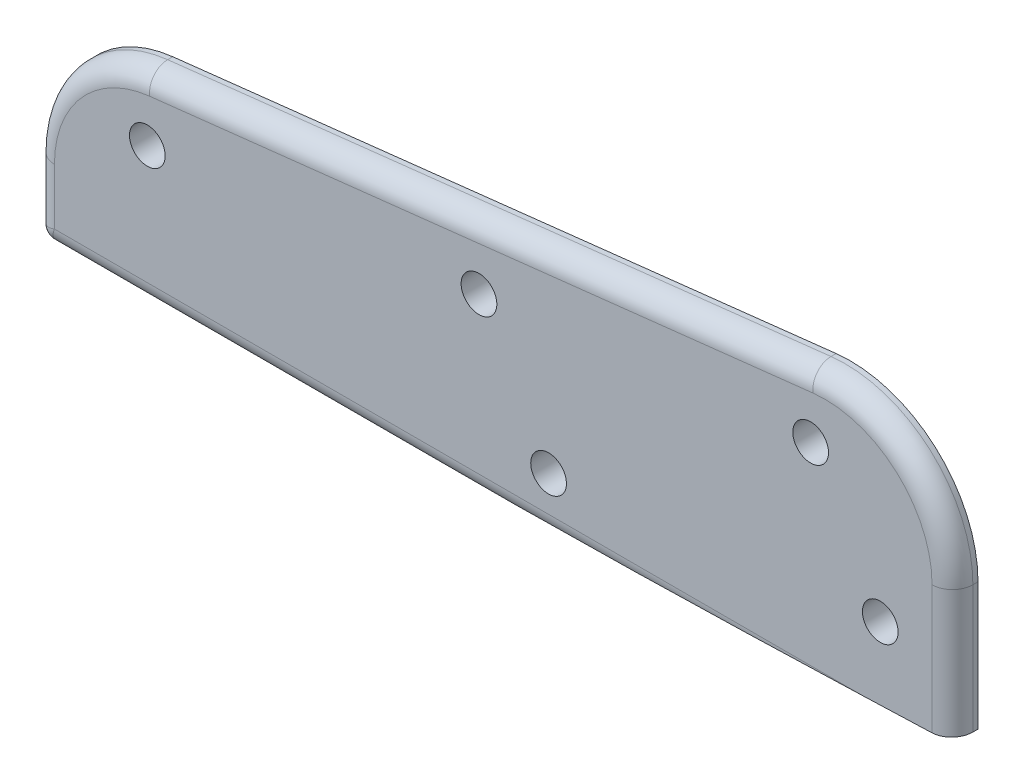
ISO-10303-21;
HEADER;
FILE_DESCRIPTION(('STEP AP214'),'2;1');
FILE_NAME('part.step','',(''),(''),'','','');
FILE_SCHEMA(('AUTOMOTIVE_DESIGN { 1 0 10303 214 1 1 1 1 }'));
ENDSEC;
DATA;
#1=APPLICATION_CONTEXT('core data for automotive mechanical design processes');
#2=APPLICATION_PROTOCOL_DEFINITION('international standard','automotive_design',2000,#1);
#3=PRODUCT_CONTEXT('',#1,'mechanical');
#4=PRODUCT('Part','Part','',(#3));
#5=PRODUCT_RELATED_PRODUCT_CATEGORY('part','',(#4));
#6=PRODUCT_DEFINITION_FORMATION('','',#4);
#7=PRODUCT_DEFINITION_CONTEXT('part definition',#1,'design');
#8=PRODUCT_DEFINITION('design','',#6,#7);
#9=PRODUCT_DEFINITION_SHAPE('','',#8);
#10=(LENGTH_UNIT() NAMED_UNIT(*) SI_UNIT(.MILLI.,.METRE.));
#11=(NAMED_UNIT(*) PLANE_ANGLE_UNIT() SI_UNIT($,.RADIAN.));
#12=(NAMED_UNIT(*) SI_UNIT($,.STERADIAN.) SOLID_ANGLE_UNIT());
#13=UNCERTAINTY_MEASURE_WITH_UNIT(LENGTH_MEASURE(1.E-05),#10,'distance_accuracy_value','');
#14=(GEOMETRIC_REPRESENTATION_CONTEXT(3) GLOBAL_UNCERTAINTY_ASSIGNED_CONTEXT((#13)) GLOBAL_UNIT_ASSIGNED_CONTEXT((#10,
#11,#12)) REPRESENTATION_CONTEXT('',''));
#15=CARTESIAN_POINT('',(0.,0.,0.));
#16=DIRECTION('',(0.,0.,1.));
#17=DIRECTION('',(1.,0.,0.));
#18=AXIS2_PLACEMENT_3D('',#15,#16,#17);
#19=CARTESIAN_POINT('',(-483.453171779433,1624.630304703,3065.));
#20=DIRECTION('',(0.,0.,-1.));
#21=DIRECTION('',(-1.,0.,0.));
#22=AXIS2_PLACEMENT_3D('',#19,#20,#21);
#23=CYLINDRICAL_SURFACE('',#22,49.9999999999999);
#24=DIRECTION('',(0.,0.,-1.));
#25=VECTOR('',#24,1.);
#26=CARTESIAN_POINT('',(-489.042910432827,1674.31687051094,3065.));
#27=LINE('',#26,#25);
#28=CARTESIAN_POINT('',(-489.042910432827,1674.31687051094,3057.));
#29=VERTEX_POINT('',#28);
#30=CARTESIAN_POINT('',(-489.042910432827,1674.31687051094,3055.));
#31=VERTEX_POINT('',#30);
#32=EDGE_CURVE('E120',#29,#31,#27,.T.);
#33=ORIENTED_EDGE('',*,*,#32,.F.);
#34=CARTESIAN_POINT('',(-483.453171779433,1624.630304703,3057.));
#35=DIRECTION('',(0.,0.,1.));
#36=DIRECTION('',(1.,0.,0.));
#37=AXIS2_PLACEMENT_3D('',#34,#35,#36);
#38=CIRCLE('',#37,49.9999999999999);
#39=CARTESIAN_POINT('',(-433.453171779433,1624.630304703,3057.));
#40=VERTEX_POINT('',#39);
#41=EDGE_CURVE('E204',#29,#40,#38,.F.);
#42=ORIENTED_EDGE('',*,*,#41,.T.);
#43=DIRECTION('',(0.,0.,-1.));
#44=VECTOR('',#43,1.);
#45=CARTESIAN_POINT('',(-433.453171779433,1624.630304703,3065.));
#46=LINE('',#45,#44);
#47=CARTESIAN_POINT('',(-433.453171779433,1624.630304703,3055.));
#48=VERTEX_POINT('',#47);
#49=EDGE_CURVE('E142',#40,#48,#46,.T.);
#50=ORIENTED_EDGE('',*,*,#49,.T.);
#51=CARTESIAN_POINT('',(-483.453171779433,1624.630304703,3055.));
#52=DIRECTION('',(0.,0.,1.));
#53=DIRECTION('',(1.,0.,0.));
#54=AXIS2_PLACEMENT_3D('',#51,#52,#53);
#55=CIRCLE('',#54,49.9999999999999);
#56=EDGE_CURVE('E136',#48,#31,#55,.T.);
#57=ORIENTED_EDGE('',*,*,#56,.T.);
#58=EDGE_LOOP('',(#33,#42,#50,#57));
#59=FACE_BOUND('',#58,.T.);
#60=ADVANCED_FACE('F36',(#59),#23,.T.);
#61=CARTESIAN_POINT('',(-489.042910432827,1674.31687051094,3065.));
#62=DIRECTION('',(0.111794773067865,-0.993731316158802,0.));
#63=DIRECTION('',(0.993731316158802,0.111794773067865,0.));
#64=AXIS2_PLACEMENT_3D('',#61,#62,#63);
#65=PLANE('',#64);
#66=DIRECTION('',(0.,0.,-1.));
#67=VECTOR('',#66,1.);
#68=CARTESIAN_POINT('',(-749.042910432826,1645.06687051094,3065.));
#69=LINE('',#68,#67);
#70=CARTESIAN_POINT('',(-749.042910432826,1645.06687051094,3057.));
#71=VERTEX_POINT('',#70);
#72=CARTESIAN_POINT('',(-749.042910432826,1645.06687051094,3055.));
#73=VERTEX_POINT('',#72);
#74=EDGE_CURVE('E129',#71,#73,#69,.T.);
#75=ORIENTED_EDGE('',*,*,#74,.F.);
#76=DIRECTION('',(-0.993731316158802,-0.111794773067865,0.));
#77=VECTOR('',#76,1.);
#78=CARTESIAN_POINT('',(-489.042910432827,1674.31687051094,3057.));
#79=LINE('',#78,#77);
#80=EDGE_CURVE('E45',#71,#29,#79,.F.);
#81=ORIENTED_EDGE('',*,*,#80,.T.);
#82=ORIENTED_EDGE('',*,*,#32,.T.);
#83=DIRECTION('',(-0.993731316158802,-0.111794773067865,0.));
#84=VECTOR('',#83,1.);
#85=CARTESIAN_POINT('',(-489.042910432827,1674.31687051094,3055.));
#86=LINE('',#85,#84);
#87=EDGE_CURVE('E123',#31,#73,#86,.T.);
#88=ORIENTED_EDGE('',*,*,#87,.T.);
#89=EDGE_LOOP('',(#75,#81,#82,#88));
#90=FACE_BOUND('',#89,.T.);
#91=ADVANCED_FACE('F122',(#90),#65,.F.);
#92=CARTESIAN_POINT('',(-743.453171779433,1595.380304703,3065.));
#93=DIRECTION('',(0.,0.,-1.));
#94=DIRECTION('',(-1.,0.,0.));
#95=AXIS2_PLACEMENT_3D('',#92,#93,#94);
#96=CYLINDRICAL_SURFACE('',#95,49.9999999999999);
#97=DIRECTION('',(0.,0.,-1.));
#98=VECTOR('',#97,1.);
#99=CARTESIAN_POINT('',(-793.453171779433,1595.380304703,3065.));
#100=LINE('',#99,#98);
#101=CARTESIAN_POINT('',(-793.453171779433,1595.380304703,3057.));
#102=VERTEX_POINT('',#101);
#103=CARTESIAN_POINT('',(-793.453171779433,1595.380304703,3055.));
#104=VERTEX_POINT('',#103);
#105=EDGE_CURVE('E170',#102,#104,#100,.T.);
#106=ORIENTED_EDGE('',*,*,#105,.F.);
#107=CARTESIAN_POINT('',(-743.453171779433,1595.380304703,3057.));
#108=DIRECTION('',(0.,0.,1.));
#109=DIRECTION('',(1.,0.,0.));
#110=AXIS2_PLACEMENT_3D('',#107,#108,#109);
#111=CIRCLE('',#110,49.9999999999999);
#112=EDGE_CURVE('E11',#102,#71,#111,.F.);
#113=ORIENTED_EDGE('',*,*,#112,.T.);
#114=ORIENTED_EDGE('',*,*,#74,.T.);
#115=CARTESIAN_POINT('',(-743.453171779433,1595.380304703,3055.));
#116=DIRECTION('',(0.,0.,-1.));
#117=DIRECTION('',(-1.,0.,0.));
#118=AXIS2_PLACEMENT_3D('',#115,#116,#117);
#119=CIRCLE('',#118,49.9999999999999);
#120=EDGE_CURVE('E139',#104,#73,#119,.T.);
#121=ORIENTED_EDGE('',*,*,#120,.F.);
#122=EDGE_LOOP('',(#106,#113,#114,#121));
#123=FACE_BOUND('',#122,.T.);
#124=ADVANCED_FACE('F254',(#123),#96,.T.);
#125=CARTESIAN_POINT('',(-793.453171779433,1595.380304703,3065.));
#126=DIRECTION('',(1.,0.,0.));
#127=DIRECTION('',(0.,1.,0.));
#128=AXIS2_PLACEMENT_3D('',#125,#126,#127);
#129=PLANE('',#128);
#130=DIRECTION('',(0.,0.,-1.));
#131=VECTOR('',#130,1.);
#132=CARTESIAN_POINT('',(-793.453171779433,1570.380304703,3065.));
#133=LINE('',#132,#131);
#134=CARTESIAN_POINT('',(-793.453171779433,1570.380304703,3055.));
#135=VERTEX_POINT('',#134);
#136=CARTESIAN_POINT('',(-793.453171779433,1570.380304703,3057.));
#137=VERTEX_POINT('',#136);
#138=EDGE_CURVE('E176',#135,#137,#133,.F.);
#139=ORIENTED_EDGE('',*,*,#138,.T.);
#140=DIRECTION('',(0.,-1.,0.));
#141=VECTOR('',#140,1.);
#142=CARTESIAN_POINT('',(-793.453171779433,1595.380304703,3057.));
#143=LINE('',#142,#141);
#144=EDGE_CURVE('E200',#137,#102,#143,.F.);
#145=ORIENTED_EDGE('',*,*,#144,.T.);
#146=ORIENTED_EDGE('',*,*,#105,.T.);
#147=DIRECTION('',(0.,-1.,0.));
#148=VECTOR('',#147,1.);
#149=CARTESIAN_POINT('',(-793.453171779433,1595.380304703,3055.));
#150=LINE('',#149,#148);
#151=EDGE_CURVE('E154',#104,#135,#150,.T.);
#152=ORIENTED_EDGE('',*,*,#151,.T.);
#153=EDGE_LOOP('',(#139,#145,#146,#152));
#154=FACE_BOUND('',#153,.T.);
#155=ADVANCED_FACE('F302',(#154),#129,.F.);
#156=CARTESIAN_POINT('',(-793.453171779433,1565.380304703,3065.));
#157=DIRECTION('',(0.,1.,0.));
#158=DIRECTION('',(0.,0.,1.));
#159=AXIS2_PLACEMENT_3D('',#156,#157,#158);
#160=PLANE('',#159);
#161=DIRECTION('',(0.,0.,-1.));
#162=VECTOR('',#161,1.);
#163=CARTESIAN_POINT('',(-693.453171779433,1565.380304703,3065.));
#164=LINE('',#163,#162);
#165=CARTESIAN_POINT('',(-693.453171779433,1565.380304703,3057.));
#166=VERTEX_POINT('',#165);
#167=CARTESIAN_POINT('',(-693.453171779433,1565.380304703,3055.));
#168=VERTEX_POINT('',#167);
#169=EDGE_CURVE('E168',#166,#168,#164,.T.);
#170=ORIENTED_EDGE('',*,*,#169,.F.);
#171=DIRECTION('',(1.,0.,0.));
#172=VECTOR('',#171,1.);
#173=CARTESIAN_POINT('',(-788.453171779433,1565.380304703,3057.));
#174=LINE('',#173,#172);
#175=CARTESIAN_POINT('',(-788.453171779433,1565.380304703,3057.));
#176=VERTEX_POINT('',#175);
#177=EDGE_CURVE('E196',#166,#176,#174,.F.);
#178=ORIENTED_EDGE('',*,*,#177,.T.);
#179=DIRECTION('',(0.,0.,-1.));
#180=VECTOR('',#179,1.);
#181=CARTESIAN_POINT('',(-788.453171779433,1565.380304703,3065.));
#182=LINE('',#181,#180);
#183=CARTESIAN_POINT('',(-788.453171779433,1565.380304703,3055.));
#184=VERTEX_POINT('',#183);
#185=EDGE_CURVE('E128',#176,#184,#182,.T.);
#186=ORIENTED_EDGE('',*,*,#185,.T.);
#187=DIRECTION('',(1.,0.,0.));
#188=VECTOR('',#187,1.);
#189=CARTESIAN_POINT('',(-793.453171779433,1565.380304703,3055.));
#190=LINE('',#189,#188);
#191=EDGE_CURVE('E157',#184,#168,#190,.T.);
#192=ORIENTED_EDGE('',*,*,#191,.T.);
#193=EDGE_LOOP('',(#170,#178,#186,#192));
#194=FACE_BOUND('',#193,.T.);
#195=ADVANCED_FACE('F307',(#194),#160,.F.);
#196=CARTESIAN_POINT('',(-693.453171779433,1565.380304703,3065.));
#197=DIRECTION('',(-0.0355544292615045,0.999367741404479,0.));
#198=DIRECTION('',(-0.999367741404479,-0.0355544292615045,0.));
#199=AXIS2_PLACEMENT_3D('',#196,#197,#198);
#200=PLANE('',#199);
#201=DIRECTION('',(0.999367741404478,0.0355544292615045,0.));
#202=VECTOR('',#201,1.);
#203=CARTESIAN_POINT('',(-693.453171779433,1565.380304703,3065.));
#204=LINE('',#203,#202);
#205=CARTESIAN_POINT('',(-468.588306914562,1573.380304703,3065.));
#206=VERTEX_POINT('',#205);
#207=CARTESIAN_POINT('',(-441.453171779433,1574.34568931838,3065.));
#208=VERTEX_POINT('',#207);
#209=EDGE_CURVE('E150',#206,#208,#204,.T.);
#210=ORIENTED_EDGE('',*,*,#209,.F.);
#211=CARTESIAN_POINT('',(-468.588306914562,1573.380304703,3057.));
#212=DIRECTION('',(-0.0355544292615045,0.999367741404479,0.));
#213=DIRECTION('',(-0.999367741404479,-0.0355544292615045,0.));
#214=AXIS2_PLACEMENT_3D('',#211,#212,#213);
#215=ELLIPSE('',#214,225.007127555321,8.);
#216=EDGE_CURVE('E194',#206,#166,#215,.F.);
#217=ORIENTED_EDGE('',*,*,#216,.T.);
#218=ORIENTED_EDGE('',*,*,#169,.T.);
#219=DIRECTION('',(0.999367741404478,0.0355544292615045,0.));
#220=VECTOR('',#219,1.);
#221=CARTESIAN_POINT('',(-693.453171779433,1565.380304703,3055.));
#222=LINE('',#221,#220);
#223=CARTESIAN_POINT('',(-433.453171779433,1574.630304703,3055.));
#224=VERTEX_POINT('',#223);
#225=EDGE_CURVE('E160',#168,#224,#222,.T.);
#226=ORIENTED_EDGE('',*,*,#225,.T.);
#227=DIRECTION('',(0.,0.,-1.));
#228=VECTOR('',#227,1.);
#229=CARTESIAN_POINT('',(-433.453171779433,1574.630304703,3065.));
#230=LINE('',#229,#228);
#231=CARTESIAN_POINT('',(-433.453171779433,1574.630304703,3057.));
#232=VERTEX_POINT('',#231);
#233=EDGE_CURVE('E166',#232,#224,#230,.T.);
#234=ORIENTED_EDGE('',*,*,#233,.F.);
#235=CARTESIAN_POINT('',(-441.453171779433,1574.34568931838,3057.));
#236=DIRECTION('',(-0.0355544292615045,0.999367741404479,0.));
#237=DIRECTION('',(-0.999367741404479,-0.0355544292615045,0.));
#238=AXIS2_PLACEMENT_3D('',#235,#236,#237);
#239=ELLIPSE('',#238,8.00506126879487,8.);
#240=EDGE_CURVE('E192',#232,#208,#239,.F.);
#241=ORIENTED_EDGE('',*,*,#240,.T.);
#242=EDGE_LOOP('',(#210,#217,#218,#226,#234,#241));
#243=FACE_BOUND('',#242,.T.);
#244=ADVANCED_FACE('F283',(#243),#200,.F.);
#245=CARTESIAN_POINT('',(-433.453171779433,1574.630304703,3065.));
#246=DIRECTION('',(-1.,0.,0.));
#247=DIRECTION('',(0.,0.,1.));
#248=AXIS2_PLACEMENT_3D('',#245,#246,#247);
#249=PLANE('',#248);
#250=ORIENTED_EDGE('',*,*,#49,.F.);
#251=DIRECTION('',(0.,1.,0.));
#252=VECTOR('',#251,1.);
#253=CARTESIAN_POINT('',(-433.453171779433,1574.630304703,3057.));
#254=LINE('',#253,#252);
#255=EDGE_CURVE('E202',#40,#232,#254,.F.);
#256=ORIENTED_EDGE('',*,*,#255,.T.);
#257=ORIENTED_EDGE('',*,*,#233,.T.);
#258=DIRECTION('',(0.,1.,0.));
#259=VECTOR('',#258,1.);
#260=CARTESIAN_POINT('',(-433.453171779433,1574.630304703,3055.));
#261=LINE('',#260,#259);
#262=EDGE_CURVE('E163',#224,#48,#261,.T.);
#263=ORIENTED_EDGE('',*,*,#262,.T.);
#264=EDGE_LOOP('',(#250,#256,#257,#263));
#265=FACE_BOUND('',#264,.T.);
#266=ADVANCED_FACE('F314',(#265),#249,.F.);
#267=CARTESIAN_POINT('',(-483.453171779433,1624.630304703,3065.));
#268=DIRECTION('',(0.,0.,1.));
#269=DIRECTION('',(1.,0.,0.));
#270=AXIS2_PLACEMENT_3D('',#267,#268,#269);
#271=PLANE('',#270);
#272=CARTESIAN_POINT('',(-489.042910432827,1649.15916480772,3065.));
#273=DIRECTION('',(0.,0.,-1.));
#274=DIRECTION('',(-1.,0.,0.));
#275=AXIS2_PLACEMENT_3D('',#272,#273,#274);
#276=CIRCLE('',#275,7.00000000000004);
#277=CARTESIAN_POINT('',(-496.042910432827,1649.15916480772,3065.));
#278=VERTEX_POINT('',#277);
#279=EDGE_CURVE('E144',#278,#278,#276,.T.);
#280=ORIENTED_EDGE('',*,*,#279,.T.);
#281=EDGE_LOOP('',(#280));
#282=FACE_BOUND('',#281,.T.);
#283=CARTESIAN_POINT('',(-619.042910432827,1634.53416480772,3065.));
#284=DIRECTION('',(0.,0.,-1.));
#285=DIRECTION('',(-1.,0.,0.));
#286=AXIS2_PLACEMENT_3D('',#283,#284,#285);
#287=CIRCLE('',#286,7.00000000000004);
#288=CARTESIAN_POINT('',(-626.042910432827,1634.53416480772,3065.));
#289=VERTEX_POINT('',#288);
#290=EDGE_CURVE('E343',#289,#289,#287,.T.);
#291=ORIENTED_EDGE('',*,*,#290,.T.);
#292=EDGE_LOOP('',(#291));
#293=FACE_BOUND('',#292,.T.);
#294=CARTESIAN_POINT('',(-749.042910432827,1619.90916480772,3065.));
#295=DIRECTION('',(0.,0.,-1.));
#296=DIRECTION('',(-1.,0.,0.));
#297=AXIS2_PLACEMENT_3D('',#294,#295,#296);
#298=CIRCLE('',#297,7.00000000000004);
#299=CARTESIAN_POINT('',(-756.042910432827,1619.90916480772,3065.));
#300=VERTEX_POINT('',#299);
#301=EDGE_CURVE('E348',#300,#300,#298,.T.);
#302=ORIENTED_EDGE('',*,*,#301,.T.);
#303=EDGE_LOOP('',(#302));
#304=FACE_BOUND('',#303,.T.);
#305=CARTESIAN_POINT('',(-461.765043539714,1601.91251342675,3065.));
#306=DIRECTION('',(0.,0.,-1.));
#307=DIRECTION('',(-1.,0.,0.));
#308=AXIS2_PLACEMENT_3D('',#305,#306,#307);
#309=CIRCLE('',#308,6.99999999999999);
#310=CARTESIAN_POINT('',(-468.765043539714,1601.91251342675,3065.));
#311=VERTEX_POINT('',#310);
#312=EDGE_CURVE('E358',#311,#311,#309,.T.);
#313=ORIENTED_EDGE('',*,*,#312,.T.);
#314=EDGE_LOOP('',(#313));
#315=FACE_BOUND('',#314,.T.);
#316=CARTESIAN_POINT('',(-591.765043539714,1587.28751342675,3065.));
#317=DIRECTION('',(0.,0.,-1.));
#318=DIRECTION('',(-1.,0.,0.));
#319=AXIS2_PLACEMENT_3D('',#316,#317,#318);
#320=CIRCLE('',#319,7.00000000000004);
#321=CARTESIAN_POINT('',(-598.765043539714,1587.28751342675,3065.));
#322=VERTEX_POINT('',#321);
#323=EDGE_CURVE('E364',#322,#322,#320,.T.);
#324=ORIENTED_EDGE('',*,*,#323,.T.);
#325=EDGE_LOOP('',(#324));
#326=FACE_BOUND('',#325,.T.);
#327=DIRECTION('',(0.,-1.,0.));
#328=VECTOR('',#327,1.);
#329=CARTESIAN_POINT('',(-785.453171779433,1570.380304703,3065.));
#330=LINE('',#329,#328);
#331=CARTESIAN_POINT('',(-785.453171779433,1595.380304703,3065.));
#332=VERTEX_POINT('',#331);
#333=CARTESIAN_POINT('',(-785.453171779433,1573.380304703,3065.));
#334=VERTEX_POINT('',#333);
#335=EDGE_CURVE('E187',#332,#334,#330,.T.);
#336=ORIENTED_EDGE('',*,*,#335,.T.);
#337=DIRECTION('',(1.,0.,0.));
#338=VECTOR('',#337,1.);
#339=CARTESIAN_POINT('',(-693.453171779433,1573.380304703,3065.));
#340=LINE('',#339,#338);
#341=EDGE_CURVE('E189',#334,#206,#340,.T.);
#342=ORIENTED_EDGE('',*,*,#341,.T.);
#343=ORIENTED_EDGE('',*,*,#209,.T.);
#344=DIRECTION('',(0.,1.,0.));
#345=VECTOR('',#344,1.);
#346=CARTESIAN_POINT('',(-441.453171779433,1624.630304703,3065.));
#347=LINE('',#346,#345);
#348=CARTESIAN_POINT('',(-441.453171779433,1624.630304703,3065.));
#349=VERTEX_POINT('',#348);
#350=EDGE_CURVE('E185',#208,#349,#347,.T.);
#351=ORIENTED_EDGE('',*,*,#350,.T.);
#352=CARTESIAN_POINT('',(-483.453171779433,1624.630304703,3065.));
#353=DIRECTION('',(0.,0.,1.));
#354=DIRECTION('',(1.,0.,0.));
#355=AXIS2_PLACEMENT_3D('',#352,#353,#354);
#356=CIRCLE('',#355,41.9999999999999);
#357=CARTESIAN_POINT('',(-488.148552248284,1666.36701998167,3065.));
#358=VERTEX_POINT('',#357);
#359=EDGE_CURVE('E183',#349,#358,#356,.T.);
#360=ORIENTED_EDGE('',*,*,#359,.T.);
#361=DIRECTION('',(-0.993731316158802,-0.111794773067865,0.));
#362=VECTOR('',#361,1.);
#363=CARTESIAN_POINT('',(-748.148552248283,1637.11701998167,3065.));
#364=LINE('',#363,#362);
#365=CARTESIAN_POINT('',(-748.148552248283,1637.11701998167,3065.));
#366=VERTEX_POINT('',#365);
#367=EDGE_CURVE('E181',#358,#366,#364,.T.);
#368=ORIENTED_EDGE('',*,*,#367,.T.);
#369=CARTESIAN_POINT('',(-743.453171779433,1595.380304703,3065.));
#370=DIRECTION('',(0.,0.,1.));
#371=DIRECTION('',(1.,0.,0.));
#372=AXIS2_PLACEMENT_3D('',#369,#370,#371);
#373=CIRCLE('',#372,41.9999999999999);
#374=EDGE_CURVE('E179',#366,#332,#373,.T.);
#375=ORIENTED_EDGE('',*,*,#374,.T.);
#376=EDGE_LOOP('',(#336,#342,#343,#351,#360,#368,#375));
#377=FACE_BOUND('',#376,.T.);
#378=ADVANCED_FACE('F279',(#282,#293,#304,#315,#326,#377),#271,.T.);
#379=CARTESIAN_POINT('',(-483.453171779433,1624.630304703,3055.));
#380=DIRECTION('',(0.,0.,1.));
#381=DIRECTION('',(1.,0.,0.));
#382=AXIS2_PLACEMENT_3D('',#379,#380,#381);
#383=PLANE('',#382);
#384=CARTESIAN_POINT('',(-489.042910432827,1649.15916480772,3055.));
#385=DIRECTION('',(0.,0.,-1.));
#386=DIRECTION('',(-1.,0.,0.));
#387=AXIS2_PLACEMENT_3D('',#384,#385,#386);
#388=CIRCLE('',#387,7.00000000000004);
#389=CARTESIAN_POINT('',(-496.042910432827,1649.15916480772,3055.));
#390=VERTEX_POINT('',#389);
#391=EDGE_CURVE('E147',#390,#390,#388,.T.);
#392=ORIENTED_EDGE('',*,*,#391,.F.);
#393=EDGE_LOOP('',(#392));
#394=FACE_BOUND('',#393,.T.);
#395=CARTESIAN_POINT('',(-619.042910432827,1634.53416480772,3055.));
#396=DIRECTION('',(0.,0.,-1.));
#397=DIRECTION('',(-1.,0.,0.));
#398=AXIS2_PLACEMENT_3D('',#395,#396,#397);
#399=CIRCLE('',#398,7.00000000000004);
#400=CARTESIAN_POINT('',(-626.042910432827,1634.53416480772,3055.));
#401=VERTEX_POINT('',#400);
#402=EDGE_CURVE('E346',#401,#401,#399,.T.);
#403=ORIENTED_EDGE('',*,*,#402,.F.);
#404=EDGE_LOOP('',(#403));
#405=FACE_BOUND('',#404,.T.);
#406=CARTESIAN_POINT('',(-749.042910432827,1619.90916480772,3055.));
#407=DIRECTION('',(0.,0.,-1.));
#408=DIRECTION('',(-1.,0.,0.));
#409=AXIS2_PLACEMENT_3D('',#406,#407,#408);
#410=CIRCLE('',#409,7.00000000000004);
#411=CARTESIAN_POINT('',(-756.042910432827,1619.90916480772,3055.));
#412=VERTEX_POINT('',#411);
#413=EDGE_CURVE('E352',#412,#412,#410,.T.);
#414=ORIENTED_EDGE('',*,*,#413,.F.);
#415=EDGE_LOOP('',(#414));
#416=FACE_BOUND('',#415,.T.);
#417=CARTESIAN_POINT('',(-461.765043539714,1601.91251342675,3055.));
#418=DIRECTION('',(0.,0.,-1.));
#419=DIRECTION('',(-1.,0.,0.));
#420=AXIS2_PLACEMENT_3D('',#417,#418,#419);
#421=CIRCLE('',#420,6.99999999999999);
#422=CARTESIAN_POINT('',(-468.765043539714,1601.91251342675,3055.));
#423=VERTEX_POINT('',#422);
#424=EDGE_CURVE('E361',#423,#423,#421,.T.);
#425=ORIENTED_EDGE('',*,*,#424,.F.);
#426=EDGE_LOOP('',(#425));
#427=FACE_BOUND('',#426,.T.);
#428=CARTESIAN_POINT('',(-591.765043539714,1587.28751342675,3055.));
#429=DIRECTION('',(0.,0.,-1.));
#430=DIRECTION('',(-1.,0.,0.));
#431=AXIS2_PLACEMENT_3D('',#428,#429,#430);
#432=CIRCLE('',#431,7.00000000000004);
#433=CARTESIAN_POINT('',(-598.765043539714,1587.28751342675,3055.));
#434=VERTEX_POINT('',#433);
#435=EDGE_CURVE('E366',#434,#434,#432,.T.);
#436=ORIENTED_EDGE('',*,*,#435,.F.);
#437=EDGE_LOOP('',(#436));
#438=FACE_BOUND('',#437,.T.);
#439=ORIENTED_EDGE('',*,*,#191,.F.);
#440=CARTESIAN_POINT('',(-788.453171779433,1570.380304703,3055.));
#441=DIRECTION('',(0.,0.,1.));
#442=DIRECTION('',(1.,0.,0.));
#443=AXIS2_PLACEMENT_3D('',#440,#441,#442);
#444=CIRCLE('',#443,5.);
#445=EDGE_CURVE('E174',#184,#135,#444,.F.);
#446=ORIENTED_EDGE('',*,*,#445,.T.);
#447=ORIENTED_EDGE('',*,*,#151,.F.);
#448=ORIENTED_EDGE('',*,*,#120,.T.);
#449=ORIENTED_EDGE('',*,*,#87,.F.);
#450=ORIENTED_EDGE('',*,*,#56,.F.);
#451=ORIENTED_EDGE('',*,*,#262,.F.);
#452=ORIENTED_EDGE('',*,*,#225,.F.);
#453=EDGE_LOOP('',(#439,#446,#447,#448,#449,#450,#451,#452));
#454=FACE_BOUND('',#453,.T.);
#455=ADVANCED_FACE('F134',(#394,#405,#416,#427,#438,#454),#383,.F.);
#456=CARTESIAN_POINT('',(-591.765043539714,1587.28751342675,3065.));
#457=DIRECTION('',(0.,0.,-1.));
#458=DIRECTION('',(-1.,0.,0.));
#459=AXIS2_PLACEMENT_3D('',#456,#457,#458);
#460=CYLINDRICAL_SURFACE('',#459,7.00000000000004);
#461=ORIENTED_EDGE('',*,*,#323,.F.);
#462=EDGE_LOOP('',(#461));
#463=FACE_BOUND('',#462,.T.);
#464=ORIENTED_EDGE('',*,*,#435,.T.);
#465=EDGE_LOOP('',(#464));
#466=FACE_BOUND('',#465,.T.);
#467=ADVANCED_FACE('F320',(#463,#466),#460,.F.);
#468=CARTESIAN_POINT('',(-461.765043539714,1601.91251342675,3065.));
#469=DIRECTION('',(0.,0.,-1.));
#470=DIRECTION('',(-1.,0.,0.));
#471=AXIS2_PLACEMENT_3D('',#468,#469,#470);
#472=CYLINDRICAL_SURFACE('',#471,6.99999999999999);
#473=ORIENTED_EDGE('',*,*,#312,.F.);
#474=EDGE_LOOP('',(#473));
#475=FACE_BOUND('',#474,.T.);
#476=ORIENTED_EDGE('',*,*,#424,.T.);
#477=EDGE_LOOP('',(#476));
#478=FACE_BOUND('',#477,.T.);
#479=ADVANCED_FACE('F327',(#475,#478),#472,.F.);
#480=CARTESIAN_POINT('',(-749.042910432827,1619.90916480772,3065.));
#481=DIRECTION('',(0.,0.,-1.));
#482=DIRECTION('',(-1.,0.,0.));
#483=AXIS2_PLACEMENT_3D('',#480,#481,#482);
#484=CYLINDRICAL_SURFACE('',#483,7.00000000000004);
#485=ORIENTED_EDGE('',*,*,#301,.F.);
#486=EDGE_LOOP('',(#485));
#487=FACE_BOUND('',#486,.T.);
#488=ORIENTED_EDGE('',*,*,#413,.T.);
#489=EDGE_LOOP('',(#488));
#490=FACE_BOUND('',#489,.T.);
#491=ADVANCED_FACE('F331',(#487,#490),#484,.F.);
#492=CARTESIAN_POINT('',(-619.042910432827,1634.53416480772,3065.));
#493=DIRECTION('',(0.,0.,-1.));
#494=DIRECTION('',(-1.,0.,0.));
#495=AXIS2_PLACEMENT_3D('',#492,#493,#494);
#496=CYLINDRICAL_SURFACE('',#495,7.00000000000004);
#497=ORIENTED_EDGE('',*,*,#290,.F.);
#498=EDGE_LOOP('',(#497));
#499=FACE_BOUND('',#498,.T.);
#500=ORIENTED_EDGE('',*,*,#402,.T.);
#501=EDGE_LOOP('',(#500));
#502=FACE_BOUND('',#501,.T.);
#503=ADVANCED_FACE('F263',(#499,#502),#496,.F.);
#504=CARTESIAN_POINT('',(-489.042910432827,1649.15916480772,3065.));
#505=DIRECTION('',(0.,0.,-1.));
#506=DIRECTION('',(-1.,0.,0.));
#507=AXIS2_PLACEMENT_3D('',#504,#505,#506);
#508=CYLINDRICAL_SURFACE('',#507,7.00000000000004);
#509=ORIENTED_EDGE('',*,*,#279,.F.);
#510=EDGE_LOOP('',(#509));
#511=FACE_BOUND('',#510,.T.);
#512=ORIENTED_EDGE('',*,*,#391,.T.);
#513=EDGE_LOOP('',(#512));
#514=FACE_BOUND('',#513,.T.);
#515=ADVANCED_FACE('F258',(#511,#514),#508,.F.);
#516=CARTESIAN_POINT('',(-788.453171779433,1570.380304703,3065.));
#517=DIRECTION('',(0.,0.,-1.));
#518=DIRECTION('',(-1.,0.,0.));
#519=AXIS2_PLACEMENT_3D('',#516,#517,#518);
#520=CYLINDRICAL_SURFACE('',#519,5.);
#521=ORIENTED_EDGE('',*,*,#185,.F.);
#522=CARTESIAN_POINT('',(-788.453171779433,1570.380304703,3057.));
#523=DIRECTION('',(0.,0.,-1.));
#524=DIRECTION('',(-1.,0.,0.));
#525=AXIS2_PLACEMENT_3D('',#522,#523,#524);
#526=CIRCLE('',#525,5.);
#527=EDGE_CURVE('E198',#176,#137,#526,.T.);
#528=ORIENTED_EDGE('',*,*,#527,.T.);
#529=ORIENTED_EDGE('',*,*,#138,.F.);
#530=ORIENTED_EDGE('',*,*,#445,.F.);
#531=EDGE_LOOP('',(#521,#528,#529,#530));
#532=FACE_BOUND('',#531,.T.);
#533=ADVANCED_FACE('F246',(#532),#520,.T.);
#534=CARTESIAN_POINT('',(-441.453171779433,1624.630304703,3057.));
#535=DIRECTION('',(0.,-1.,0.));
#536=DIRECTION('',(0.,0.,-1.));
#537=AXIS2_PLACEMENT_3D('',#534,#535,#536);
#538=CYLINDRICAL_SURFACE('',#537,8.);
#539=ORIENTED_EDGE('',*,*,#240,.F.);
#540=ORIENTED_EDGE('',*,*,#255,.F.);
#541=CARTESIAN_POINT('',(-441.453171779433,1624.630304703,3057.));
#542=DIRECTION('',(0.,1.,0.));
#543=DIRECTION('',(0.,0.,1.));
#544=AXIS2_PLACEMENT_3D('',#541,#542,#543);
#545=CIRCLE('',#544,8.);
#546=EDGE_CURVE('E40',#349,#40,#545,.T.);
#547=ORIENTED_EDGE('',*,*,#546,.F.);
#548=ORIENTED_EDGE('',*,*,#350,.F.);
#549=EDGE_LOOP('',(#539,#540,#547,#548));
#550=FACE_BOUND('',#549,.T.);
#551=ADVANCED_FACE('F38',(#550),#538,.T.);
#552=CARTESIAN_POINT('',(-483.453171779433,1624.630304703,3057.));
#553=DIRECTION('',(0.,0.,1.));
#554=DIRECTION('',(1.,0.,0.));
#555=AXIS2_PLACEMENT_3D('',#552,#553,#554);
#556=TOROIDAL_SURFACE('',#555,41.9999999999999,8.);
#557=ORIENTED_EDGE('',*,*,#546,.T.);
#558=ORIENTED_EDGE('',*,*,#41,.F.);
#559=CARTESIAN_POINT('',(-488.148552248284,1666.36701998167,3057.));
#560=DIRECTION('',(-0.993731316158802,-0.111794773067866,0.));
#561=DIRECTION('',(0.111794773067866,-0.993731316158802,0.));
#562=AXIS2_PLACEMENT_3D('',#559,#560,#561);
#563=CIRCLE('',#562,8.);
#564=EDGE_CURVE('E294',#358,#29,#563,.T.);
#565=ORIENTED_EDGE('',*,*,#564,.F.);
#566=ORIENTED_EDGE('',*,*,#359,.F.);
#567=EDGE_LOOP('',(#557,#558,#565,#566));
#568=FACE_BOUND('',#567,.T.);
#569=ADVANCED_FACE('F239',(#568),#556,.T.);
#570=CARTESIAN_POINT('',(-488.148552248284,1666.36701998167,3057.));
#571=DIRECTION('',(0.993731316158802,0.111794773067865,0.));
#572=DIRECTION('',(-0.111794773067865,0.993731316158802,0.));
#573=AXIS2_PLACEMENT_3D('',#570,#571,#572);
#574=CYLINDRICAL_SURFACE('',#573,8.);
#575=ORIENTED_EDGE('',*,*,#564,.T.);
#576=ORIENTED_EDGE('',*,*,#80,.F.);
#577=CARTESIAN_POINT('',(-748.148552248283,1637.11701998167,3057.));
#578=DIRECTION('',(-0.993731316158802,-0.111794773067859,0.));
#579=DIRECTION('',(0.111794773067859,-0.993731316158803,0.));
#580=AXIS2_PLACEMENT_3D('',#577,#578,#579);
#581=CIRCLE('',#580,8.);
#582=EDGE_CURVE('E295',#366,#71,#581,.T.);
#583=ORIENTED_EDGE('',*,*,#582,.F.);
#584=ORIENTED_EDGE('',*,*,#367,.F.);
#585=EDGE_LOOP('',(#575,#576,#583,#584));
#586=FACE_BOUND('',#585,.T.);
#587=ADVANCED_FACE('F236',(#586),#574,.T.);
#588=CARTESIAN_POINT('',(-743.453171779433,1595.380304703,3057.));
#589=DIRECTION('',(0.,0.,1.));
#590=DIRECTION('',(1.,0.,0.));
#591=AXIS2_PLACEMENT_3D('',#588,#589,#590);
#592=TOROIDAL_SURFACE('',#591,41.9999999999999,8.);
#593=ORIENTED_EDGE('',*,*,#582,.T.);
#594=ORIENTED_EDGE('',*,*,#112,.F.);
#595=CARTESIAN_POINT('',(-785.453171779433,1595.380304703,3057.));
#596=DIRECTION('',(0.,-1.,0.));
#597=DIRECTION('',(0.,0.,-1.));
#598=AXIS2_PLACEMENT_3D('',#595,#596,#597);
#599=CIRCLE('',#598,8.);
#600=EDGE_CURVE('E213',#332,#102,#599,.T.);
#601=ORIENTED_EDGE('',*,*,#600,.F.);
#602=ORIENTED_EDGE('',*,*,#374,.F.);
#603=EDGE_LOOP('',(#593,#594,#601,#602));
#604=FACE_BOUND('',#603,.T.);
#605=ADVANCED_FACE('F232',(#604),#592,.T.);
#606=CARTESIAN_POINT('',(-785.453171779433,1624.630304703,3057.));
#607=DIRECTION('',(0.,1.,0.));
#608=DIRECTION('',(-1.,0.,0.));
#609=AXIS2_PLACEMENT_3D('',#606,#607,#608);
#610=CYLINDRICAL_SURFACE('',#609,8.);
#611=ORIENTED_EDGE('',*,*,#600,.T.);
#612=ORIENTED_EDGE('',*,*,#144,.F.);
#613=CARTESIAN_POINT('',(-785.453171779433,1573.380304703,3057.));
#614=DIRECTION('',(0.35112344158838,-0.936329177569049,0.));
#615=DIRECTION('',(-0.936329177569049,-0.35112344158838,0.));
#616=AXIS2_PLACEMENT_3D('',#613,#614,#615);
#617=ELLIPSE('',#616,8.5440037453175,8.);
#618=EDGE_CURVE('E210',#334,#137,#617,.T.);
#619=ORIENTED_EDGE('',*,*,#618,.F.);
#620=ORIENTED_EDGE('',*,*,#335,.F.);
#621=EDGE_LOOP('',(#611,#612,#619,#620));
#622=FACE_BOUND('',#621,.T.);
#623=ADVANCED_FACE('F225',(#622),#610,.T.);
#624=CARTESIAN_POINT('',(-785.453171779433,1573.380304703,3049.));
#625=CARTESIAN_POINT('',(-785.453171779433,1573.380304703,3049.));
#626=CARTESIAN_POINT('',(-785.453171779433,1573.380304703,3049.));
#627=CARTESIAN_POINT('',(-785.518531989589,1573.20601080925,3049.0000100412));
#628=CARTESIAN_POINT('',(-785.572999156956,1573.26047732548,3049.00000830054));
#629=CARTESIAN_POINT('',(-785.627465673183,1573.31494449284,3049.0000100412));
#630=CARTESIAN_POINT('',(-785.583882771885,1573.03174205646,3049.00569578655));
#631=CARTESIAN_POINT('',(-785.692893707977,1573.14058277446,3049.00213581795));
#632=CARTESIAN_POINT('',(-785.801734425972,1573.24959371055,3049.00569578655));
#633=CARTESIAN_POINT('',(-785.71444946733,1572.68356420194,3049.02848630968));
#634=CARTESIAN_POINT('',(-785.93296537836,1572.90051110407,3049.01071144595));
#635=CARTESIAN_POINT('',(-786.149912280492,1573.1190270151,3049.02848630968));
#636=CARTESIAN_POINT('',(-785.779665368773,1572.50965513143,3049.04559204004));
#637=CARTESIAN_POINT('',(-786.053314089591,1572.78016239284,3049.01717219847));
#638=CARTESIAN_POINT('',(-786.323821351006,1573.05381111366,3049.04559204004));
#639=CARTESIAN_POINT('',(-785.973773805219,1571.99203263424,3049.11373674182));
#640=CARTESIAN_POINT('',(-786.413877343617,1572.41959913882,3049.04312611124));
#641=CARTESIAN_POINT('',(-786.841443848195,1572.85970267722,3049.11373674182));
#642=CARTESIAN_POINT('',(-786.10228278187,1571.64934202984,3049.1816028168));
#643=CARTESIAN_POINT('',(-786.655728550405,1572.17774793203,3049.06927236038));
#644=CARTESIAN_POINT('',(-787.184134452597,1572.73119370056,3049.1816028168));
#645=CARTESIAN_POINT('',(-786.35483907673,1570.97585857688,3049.36205778184));
#646=CARTESIAN_POINT('',(-787.141100865267,1571.69237561717,3049.14097676348));
#647=CARTESIAN_POINT('',(-787.857617905558,1572.4786374057,3049.36205778184));
#648=CARTESIAN_POINT('',(-786.478925076445,1570.64496257764,3049.47387744525));
#649=CARTESIAN_POINT('',(-787.385963125392,1571.44751335704,3049.18662533993));
#650=CARTESIAN_POINT('',(-788.188513904798,1572.35455140599,3049.47387744525));
#651=CARTESIAN_POINT('',(-786.720506364143,1570.00074581044,3049.74072226558));
#652=CARTESIAN_POINT('',(-787.879023925031,1570.9544525574,3049.30088290606));
#653=CARTESIAN_POINT('',(-788.832730671994,1572.11297011829,3049.74072226558));
#654=CARTESIAN_POINT('',(-786.838088708309,1569.68719289267,3049.8946152232));
#655=CARTESIAN_POINT('',(-788.128516730547,1570.70495975189,3049.36960854207));
#656=CARTESIAN_POINT('',(-789.146283589768,1571.99538777413,3049.8946152232));
#657=CARTESIAN_POINT('',(-787.064591748882,1569.08318478447,3050.24333861604));
#658=CARTESIAN_POINT('',(-788.632255028119,1570.20122145432,3049.5359096486));
#659=CARTESIAN_POINT('',(-789.750291697963,1571.76888473355,3050.24333861604));
#660=CARTESIAN_POINT('',(-787.173669017192,1568.79231206898,3050.43671009154));
#661=CARTESIAN_POINT('',(-788.887704370181,1569.94577211225,3049.63359129007));
#662=CARTESIAN_POINT('',(-790.041164413456,1571.65980746524,3050.43671009154));
#663=CARTESIAN_POINT('',(-787.38122389225,1568.23883240216,3050.86141226315));
#664=CARTESIAN_POINT('',(-789.403966628424,1569.42950985401,3049.86686083829));
#665=CARTESIAN_POINT('',(-790.594644080279,1571.45225259018,3050.86141226315));
#666=CARTESIAN_POINT('',(-787.479946763615,1567.97557141185,3051.09102162112));
#667=CARTESIAN_POINT('',(-789.665823746684,1569.16765273575,3050.00246853001));
#668=CARTESIAN_POINT('',(-790.857905070585,1571.35352971882,3051.09102162112));
#669=CARTESIAN_POINT('',(-787.665009649647,1567.48207038243,3051.58452885754));
#670=CARTESIAN_POINT('',(-790.193390863904,1568.64008561853,3050.32447195692));
#671=CARTESIAN_POINT('',(-791.351406100004,1571.16846683279,3051.58452885754));
#672=CARTESIAN_POINT('',(-787.751698024111,1567.25090138386,3051.84654924499));
#673=CARTESIAN_POINT('',(-790.45988824112,1568.37358824131,3050.51065721902));
#674=CARTESIAN_POINT('',(-791.582575098573,1571.08177845832,3051.84654924499));
#675=CARTESIAN_POINT('',(-787.91110079208,1566.82582733594,3052.40053144125));
#676=CARTESIAN_POINT('',(-790.990934147161,1567.84254233527,3050.950225161));
#677=CARTESIAN_POINT('',(-792.007649146489,1570.92237569035,3052.40053144125));
#678=CARTESIAN_POINT('',(-787.984268149912,1566.63071438172,3052.69061807453));
#679=CARTESIAN_POINT('',(-791.255898362478,1567.57757811996,3051.20291858864));
#680=CARTESIAN_POINT('',(-792.20276210071,1570.84920833252,3052.69061807453));
#681=CARTESIAN_POINT('',(-788.115269725572,1566.28137684663,3053.29571834333));
#682=CARTESIAN_POINT('',(-791.77095763785,1567.06251884458,3051.79268078992));
#683=CARTESIAN_POINT('',(-792.552099635803,1570.71820675686,3053.29571834333));
#684=CARTESIAN_POINT('',(-788.173638407383,1566.12572702847,3053.60906529432));
#685=CARTESIAN_POINT('',(-792.02100464395,1566.81247183848,3052.12820393008));
#686=CARTESIAN_POINT('',(-792.707749453965,1570.65983807505,3053.60906529432));
#687=CARTESIAN_POINT('',(-788.273967570236,1565.85818259419,3054.25502778752));
#688=CARTESIAN_POINT('',(-792.484188565287,1566.34928791715,3052.89463485973));
#689=CARTESIAN_POINT('',(-792.975293888241,1570.5595089122,3054.25502778752));
#690=CARTESIAN_POINT('',(-788.316483602231,1565.74480650887,3054.58639892181));
#691=CARTESIAN_POINT('',(-792.6968286371,1566.13664784533,3053.32268035805));
#692=CARTESIAN_POINT('',(-793.088669973561,1570.5169928802,3054.58639892181));
#693=CARTESIAN_POINT('',(-788.384380031892,1565.56374936311,3055.26219580964));
#694=CARTESIAN_POINT('',(-793.056106025294,1565.77737045714,3054.26827627248));
#695=CARTESIAN_POINT('',(-793.269727119322,1570.44909645054,3055.26219580964));
#696=CARTESIAN_POINT('',(-788.410236620392,1565.49479846044,3055.60593081805));
#697=CARTESIAN_POINT('',(-793.202017402274,1565.63145908016,3054.78131365991));
#698=CARTESIAN_POINT('',(-793.338678021991,1570.42323986204,3055.60593081805));
#699=CARTESIAN_POINT('',(-788.444492768883,1565.40344873114,3056.29991009786));
#700=CARTESIAN_POINT('',(-793.400821867145,1565.43265461529,3055.86579939747));
#701=CARTESIAN_POINT('',(-793.430027751299,1570.38898371355,3056.29991009786));
#702=CARTESIAN_POINT('',(-788.453171779433,1565.380304703,3056.64995504893));
#703=CARTESIAN_POINT('',(-793.453171779433,1565.380304703,3056.43124484578));
#704=CARTESIAN_POINT('',(-793.453171779433,1570.380304703,3056.64995504893));
#705=CARTESIAN_POINT('',(-788.453171779433,1565.380304703,3057.35004495107));
#706=CARTESIAN_POINT('',(-793.453171779433,1565.380304703,3057.56875515422));
#707=CARTESIAN_POINT('',(-793.453171779433,1570.380304703,3057.35004495107));
#708=CARTESIAN_POINT('',(-788.444492768883,1565.40344873114,3057.70008990214));
#709=CARTESIAN_POINT('',(-793.400821867145,1565.43265461529,3058.13420060253));
#710=CARTESIAN_POINT('',(-793.430027751299,1570.38898371355,3057.70008990214));
#711=CARTESIAN_POINT('',(-788.410236620392,1565.49479846044,3058.39406918195));
#712=CARTESIAN_POINT('',(-793.202017402274,1565.63145908016,3059.21868634009));
#713=CARTESIAN_POINT('',(-793.338678021991,1570.42323986204,3058.39406918195));
#714=CARTESIAN_POINT('',(-788.384380031892,1565.56374936311,3058.73780419035));
#715=CARTESIAN_POINT('',(-793.056106025294,1565.77737045714,3059.73172372752));
#716=CARTESIAN_POINT('',(-793.269727119322,1570.44909645054,3058.73780419035));
#717=CARTESIAN_POINT('',(-788.316483602231,1565.74480650887,3059.41360107818));
#718=CARTESIAN_POINT('',(-792.6968286371,1566.13664784533,3060.67731964195));
#719=CARTESIAN_POINT('',(-793.088669973561,1570.5169928802,3059.41360107818));
#720=CARTESIAN_POINT('',(-788.273967570236,1565.85818259419,3059.74497221248));
#721=CARTESIAN_POINT('',(-792.484188565287,1566.34928791715,3061.10536514027));
#722=CARTESIAN_POINT('',(-792.975293888241,1570.5595089122,3059.74497221248));
#723=CARTESIAN_POINT('',(-788.173638407383,1566.12572702847,3060.39093470568));
#724=CARTESIAN_POINT('',(-792.02100464395,1566.81247183848,3061.87179606992));
#725=CARTESIAN_POINT('',(-792.707749453965,1570.65983807505,3060.39093470568));
#726=CARTESIAN_POINT('',(-788.115269725572,1566.28137684663,3060.70428165667));
#727=CARTESIAN_POINT('',(-791.77095763785,1567.06251884458,3062.20731921008));
#728=CARTESIAN_POINT('',(-792.552099635803,1570.71820675686,3060.70428165667));
#729=CARTESIAN_POINT('',(-787.984268149912,1566.63071438172,3061.30938192547));
#730=CARTESIAN_POINT('',(-791.255898362478,1567.57757811996,3062.79708141135));
#731=CARTESIAN_POINT('',(-792.20276210071,1570.84920833252,3061.30938192547));
#732=CARTESIAN_POINT('',(-787.91110079208,1566.82582733594,3061.59946855875));
#733=CARTESIAN_POINT('',(-790.990934147161,1567.84254233527,3063.049774839));
#734=CARTESIAN_POINT('',(-792.007649146489,1570.92237569035,3061.59946855875));
#735=CARTESIAN_POINT('',(-787.751698024111,1567.25090138386,3062.15345075501));
#736=CARTESIAN_POINT('',(-790.45988824112,1568.37358824131,3063.48934278098));
#737=CARTESIAN_POINT('',(-791.582575098573,1571.08177845832,3062.15345075501));
#738=CARTESIAN_POINT('',(-787.665009649647,1567.48207038243,3062.41547114246));
#739=CARTESIAN_POINT('',(-790.193390863904,1568.64008561853,3063.67552804307));
#740=CARTESIAN_POINT('',(-791.351406100004,1571.16846683279,3062.41547114246));
#741=CARTESIAN_POINT('',(-787.479946763615,1567.97557141185,3062.90897837888));
#742=CARTESIAN_POINT('',(-789.665823746684,1569.16765273575,3063.99753146999));
#743=CARTESIAN_POINT('',(-790.857905070585,1571.35352971882,3062.90897837888));
#744=CARTESIAN_POINT('',(-787.38122389225,1568.23883240216,3063.13858773685));
#745=CARTESIAN_POINT('',(-789.403966628424,1569.42950985401,3064.13313916171));
#746=CARTESIAN_POINT('',(-790.594644080279,1571.45225259018,3063.13858773685));
#747=CARTESIAN_POINT('',(-787.173669017192,1568.79231206898,3063.56328990846));
#748=CARTESIAN_POINT('',(-788.887704370181,1569.94577211225,3064.36640870993));
#749=CARTESIAN_POINT('',(-790.041164413456,1571.65980746524,3063.56328990846));
#750=CARTESIAN_POINT('',(-787.064591748882,1569.08318478447,3063.75666138396));
#751=CARTESIAN_POINT('',(-788.632255028119,1570.20122145432,3064.4640903514));
#752=CARTESIAN_POINT('',(-789.750291697963,1571.76888473355,3063.75666138396));
#753=CARTESIAN_POINT('',(-786.838088708309,1569.68719289267,3064.10538477679));
#754=CARTESIAN_POINT('',(-788.128516730547,1570.70495975189,3064.63039145793));
#755=CARTESIAN_POINT('',(-789.146283589768,1571.99538777413,3064.10538477679));
#756=CARTESIAN_POINT('',(-786.720506364143,1570.00074581044,3064.25927773442));
#757=CARTESIAN_POINT('',(-787.879023925031,1570.9544525574,3064.69911709394));
#758=CARTESIAN_POINT('',(-788.832730671994,1572.11297011829,3064.25927773442));
#759=CARTESIAN_POINT('',(-786.478925076445,1570.64496257764,3064.52612255475));
#760=CARTESIAN_POINT('',(-787.385963125392,1571.44751335704,3064.81337466007));
#761=CARTESIAN_POINT('',(-788.188513904798,1572.35455140599,3064.52612255475));
#762=CARTESIAN_POINT('',(-786.35483907673,1570.97585857688,3064.63794221816));
#763=CARTESIAN_POINT('',(-787.141100865267,1571.69237561717,3064.85902323652));
#764=CARTESIAN_POINT('',(-787.857617905558,1572.4786374057,3064.63794221816));
#765=CARTESIAN_POINT('',(-786.10228278187,1571.64934202984,3064.81839718319));
#766=CARTESIAN_POINT('',(-786.655728550405,1572.17774793203,3064.93072763961));
#767=CARTESIAN_POINT('',(-787.184134452597,1572.73119370056,3064.81839718319));
#768=CARTESIAN_POINT('',(-785.973773805219,1571.99203263424,3064.88626325818));
#769=CARTESIAN_POINT('',(-786.413877343617,1572.41959913882,3064.95687388876));
#770=CARTESIAN_POINT('',(-786.841443848194,1572.85970267722,3064.88626325818));
#771=CARTESIAN_POINT('',(-785.779665368773,1572.50965513143,3064.95440795996));
#772=CARTESIAN_POINT('',(-786.053314089592,1572.78016239284,3064.98282780153));
#773=CARTESIAN_POINT('',(-786.323821351006,1573.05381111366,3064.95440795996));
#774=CARTESIAN_POINT('',(-785.71444946733,1572.68356420194,3064.97151369032));
#775=CARTESIAN_POINT('',(-785.93296537836,1572.90051110407,3064.98928855405));
#776=CARTESIAN_POINT('',(-786.149912280492,1573.1190270151,3064.97151369032));
#777=CARTESIAN_POINT('',(-785.583882771886,1573.03174205646,3064.99430421345));
#778=CARTESIAN_POINT('',(-785.692893707977,1573.14058277446,3064.99786418205));
#779=CARTESIAN_POINT('',(-785.801734425973,1573.24959371055,3064.99430421345));
#780=CARTESIAN_POINT('',(-785.51853198959,1573.20601080925,3064.9999899588));
#781=CARTESIAN_POINT('',(-785.572999156957,1573.26047732548,3064.99999169946));
#782=CARTESIAN_POINT('',(-785.627465673183,1573.31494449284,3064.9999899588));
#783=CARTESIAN_POINT('',(-785.453171779433,1573.380304703,3065.));
#784=CARTESIAN_POINT('',(-785.453171779433,1573.380304703,3065.));
#785=CARTESIAN_POINT('',(-785.453171779433,1573.380304703,3065.));
#786=(BOUNDED_SURFACE() B_SPLINE_SURFACE(3,2,((#624,#625,#626),(#627,#628,#629),(#630,#631,
#632),(#633,#634,#635),(#636,#637,#638),(#639,#640,#641),(#642,#643,#644),(#645,#646,#647),
(#648,#649,#650),(#651,#652,#653),(#654,#655,#656),(#657,#658,#659),(#660,#661,#662),(#663,#664,
#665),(#666,#667,#668),(#669,#670,#671),(#672,#673,#674),(#675,#676,#677),(#678,#679,#680),
(#681,#682,#683),(#684,#685,#686),(#687,#688,#689),(#690,#691,#692),(#693,#694,#695),(#696,#697,
#698),(#699,#700,#701),(#702,#703,#704),(#705,#706,#707),(#708,#709,#710),(#711,#712,#713),
(#714,#715,#716),(#717,#718,#719),(#720,#721,#722),(#723,#724,#725),(#726,#727,#728),(#729,#730,
#731),(#732,#733,#734),(#735,#736,#737),(#738,#739,#740),(#741,#742,#743),(#744,#745,#746),
(#747,#748,#749),(#750,#751,#752),(#753,#754,#755),(#756,#757,#758),(#759,#760,#761),(#762,#763,
#764),(#765,#766,#767),(#768,#769,#770),(#771,#772,#773),(#774,#775,#776),(#777,#778,#779),
(#780,#781,#782),(#783,#784,#785)),.UNSPECIFIED.,.F.,.F.,.F.) B_SPLINE_SURFACE_WITH_KNOTS((4,2,
2,2,2,2,2,2,2,2,2,2,2,2,2,2,2,2,2,2,2,2,2,2,2,2,4),(3,3),(0.,0.277248089016527,
0.554519306999115,1.10417738269518,1.64461606854101,2.17174137494007,2.68208824838154,
3.17304524234972,3.64308642765995,4.09200017726301,4.52108804375219,4.93328158161441,
5.33309839671404,5.72635557572476,6.11961275473548,6.51942956983511,6.93162310769733,
7.36071097418651,7.80962472378957,8.2796659090998,8.77062290306798,9.28096977650945,
9.80809508290851,10.3485337687543,10.8981918444504,11.1754630624332,11.4527111514495),(0.,1.),
.UNSPECIFIED.) GEOMETRIC_REPRESENTATION_ITEM() RATIONAL_B_SPLINE_SURFACE(((1.,1.,1.),(1.,
0.999999961263619,1.),(1.,0.99964392294149,1.),(1.,0.998220838286357,1.),(1.,0.997153732641156,
1.),(1.,0.992912442662745,1.),(1.,0.988698138464846,1.),(1.,0.977616679304322,1.),(1.,
0.970795206105286,1.),(1.,0.95478924088427,1.),(1.,0.945667100032622,1.),(1.,0.925487939163257,
1.),(1.,0.914501748600794,1.),(1.,0.891170005673142,1.),(1.,0.878891958919863,1.),(1.,
0.853706991171872,1.),(1.,0.840849145478561,1.),(1.,0.815387454891643,1.),(1.,0.802798170214696,
1.),(1.,0.778880732145946,1.),(1.,0.767521437015661,1.),(1.,0.747118527019454,1.),(1.,
0.73800134692011,1.),(1.,0.723039691285839,1.),(1.,0.717105167895105,1.),(1.,0.709170186453631,
1.),(1.,0.707106781186548,1.),(1.,0.707106781186548,1.),(1.,0.709170186453631,1.),(1.,
0.717105167895105,1.),(1.,0.723039691285839,1.),(1.,0.73800134692011,1.),(1.,0.747118527019454,
1.),(1.,0.767521437015661,1.),(1.,0.778880732145946,1.),(1.,0.802798170214696,1.),(1.,
0.815387454891643,1.),(1.,0.840849145478561,1.),(1.,0.853706991171872,1.),(1.,0.878891958919863,
1.),(1.,0.891170005673142,1.),(1.,0.914501748600794,1.),(1.,0.925487939163257,1.),(1.,
0.945667100032622,1.),(1.,0.95478924088427,1.),(1.,0.970795206105286,1.),(1.,0.977616679304322,
1.),(1.,0.988698138464846,1.),(1.,0.992912442662744,1.),(1.,0.997153732641157,1.),(1.,
0.998220838286359,1.),(1.,0.999643922941491,1.),(1.,0.99999996126362,1.),(1.,1.,1.))) REPRESENTATION_ITEM('') SURFACE());
#787=ORIENTED_EDGE('',*,*,#618,.T.);
#788=ORIENTED_EDGE('',*,*,#527,.F.);
#789=CARTESIAN_POINT('',(-785.453171779433,1573.380304703,3057.));
#790=DIRECTION('',(0.936329177569044,-0.351123441588392,0.));
#791=DIRECTION('',(-0.351123441588392,-0.936329177569045,0.));
#792=AXIS2_PLACEMENT_3D('',#789,#790,#791);
#793=ELLIPSE('',#792,8.54400374531754,8.);
#794=EDGE_CURVE('E207',#334,#176,#793,.T.);
#795=ORIENTED_EDGE('',*,*,#794,.F.);
#796=EDGE_LOOP('',(#787,#788,#795));
#797=FACE_BOUND('',#796,.T.);
#798=ADVANCED_FACE('F218',(#797),#786,.T.);
#799=CARTESIAN_POINT('',(-483.453171779433,1573.380304703,3057.));
#800=DIRECTION('',(-1.,0.,0.));
#801=DIRECTION('',(0.,0.,1.));
#802=AXIS2_PLACEMENT_3D('',#799,#800,#801);
#803=CYLINDRICAL_SURFACE('',#802,8.);
#804=ORIENTED_EDGE('',*,*,#794,.T.);
#805=ORIENTED_EDGE('',*,*,#177,.F.);
#806=ORIENTED_EDGE('',*,*,#216,.F.);
#807=ORIENTED_EDGE('',*,*,#341,.F.);
#808=EDGE_LOOP('',(#804,#805,#806,#807));
#809=FACE_BOUND('',#808,.T.);
#810=ADVANCED_FACE('F224',(#809),#803,.T.);
#811=CLOSED_SHELL('',(#60,#91,#124,#155,#195,#244,#266,#378,#455,#467,#479,#491,#503,#515,#533,
#551,#569,#587,#605,#623,#798,#810));
#812=MANIFOLD_SOLID_BREP('B2',#811);
#813=ADVANCED_BREP_SHAPE_REPRESENTATION('',(#18,#812),#14);
#814=SHAPE_DEFINITION_REPRESENTATION(#9,#813);
ENDSEC;
END-ISO-10303-21;
